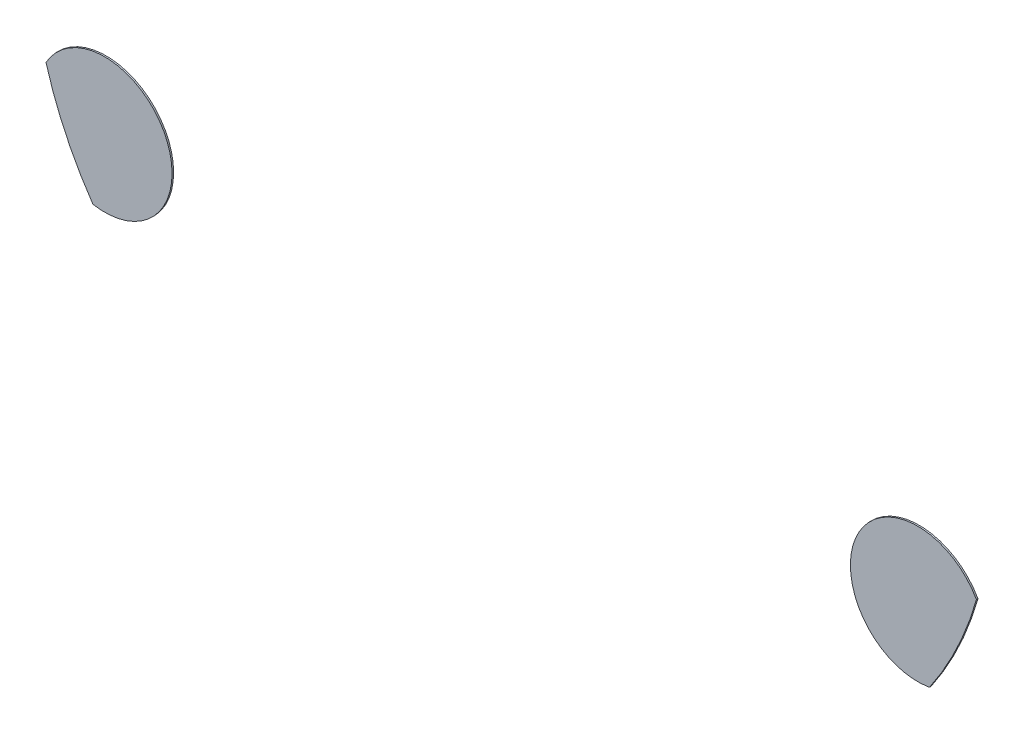
ISO-10303-21;
HEADER;
FILE_DESCRIPTION(('STEP AP214'),'2;1');
FILE_NAME('part.step','',(''),(''),'','','');
FILE_SCHEMA(('AUTOMOTIVE_DESIGN { 1 0 10303 214 1 1 1 1 }'));
ENDSEC;
DATA;
#1=APPLICATION_CONTEXT('core data for automotive mechanical design processes');
#2=APPLICATION_PROTOCOL_DEFINITION('international standard','automotive_design',2000,#1);
#3=PRODUCT_CONTEXT('',#1,'mechanical');
#4=PRODUCT('Part','Part','',(#3));
#5=PRODUCT_RELATED_PRODUCT_CATEGORY('part','',(#4));
#6=PRODUCT_DEFINITION_FORMATION('','',#4);
#7=PRODUCT_DEFINITION_CONTEXT('part definition',#1,'design');
#8=PRODUCT_DEFINITION('design','',#6,#7);
#9=PRODUCT_DEFINITION_SHAPE('','',#8);
#10=(LENGTH_UNIT() NAMED_UNIT(*) SI_UNIT(.MILLI.,.METRE.));
#11=(NAMED_UNIT(*) PLANE_ANGLE_UNIT() SI_UNIT($,.RADIAN.));
#12=(NAMED_UNIT(*) SI_UNIT($,.STERADIAN.) SOLID_ANGLE_UNIT());
#13=UNCERTAINTY_MEASURE_WITH_UNIT(LENGTH_MEASURE(1.E-05),#10,'distance_accuracy_value','');
#14=(GEOMETRIC_REPRESENTATION_CONTEXT(3) GLOBAL_UNCERTAINTY_ASSIGNED_CONTEXT((#13)) GLOBAL_UNIT_ASSIGNED_CONTEXT((#10,
#11,#12)) REPRESENTATION_CONTEXT('',''));
#15=CARTESIAN_POINT('',(0.,0.,0.));
#16=DIRECTION('',(0.,0.,1.));
#17=DIRECTION('',(1.,0.,0.));
#18=AXIS2_PLACEMENT_3D('',#15,#16,#17);
#19=CARTESIAN_POINT('',(60.1352829441877,31.3870417419867,0.1));
#20=DIRECTION('',(0.,0.,-1.));
#21=DIRECTION('',(-1.,0.,0.));
#22=AXIS2_PLACEMENT_3D('',#19,#20,#21);
#23=CYLINDRICAL_SURFACE('',#22,4.34647340931751);
#24=CARTESIAN_POINT('',(60.1352829441877,31.3870417419867,0.));
#25=DIRECTION('',(0.,0.,1.));
#26=DIRECTION('',(1.,0.,0.));
#27=AXIS2_PLACEMENT_3D('',#24,#25,#26);
#28=CIRCLE('',#27,4.34647340931751);
#29=CARTESIAN_POINT('',(63.9221170212046,33.5205174908639,0.));
#30=VERTEX_POINT('',#29);
#31=CARTESIAN_POINT('',(60.8938389119322,27.1072725961445,0.));
#32=VERTEX_POINT('',#31);
#33=EDGE_CURVE('E74',#30,#32,#28,.T.);
#34=ORIENTED_EDGE('',*,*,#33,.T.);
#35=DIRECTION('',(0.,0.,-1.));
#36=VECTOR('',#35,1.);
#37=CARTESIAN_POINT('',(60.8938389119322,27.1072725961445,0.1));
#38=LINE('',#37,#36);
#39=CARTESIAN_POINT('',(60.8938389119322,27.1072725961445,0.1));
#40=VERTEX_POINT('',#39);
#41=EDGE_CURVE('E12',#40,#32,#38,.T.);
#42=ORIENTED_EDGE('',*,*,#41,.F.);
#43=CARTESIAN_POINT('',(60.1352829441877,31.3870417419867,0.1));
#44=DIRECTION('',(0.,0.,1.));
#45=DIRECTION('',(1.,0.,0.));
#46=AXIS2_PLACEMENT_3D('',#43,#44,#45);
#47=CIRCLE('',#46,4.34647340931751);
#48=CARTESIAN_POINT('',(63.9221170212046,33.5205174908639,0.1));
#49=VERTEX_POINT('',#48);
#50=EDGE_CURVE('E73',#49,#40,#47,.T.);
#51=ORIENTED_EDGE('',*,*,#50,.F.);
#52=DIRECTION('',(0.,0.,-1.));
#53=VECTOR('',#52,1.);
#54=CARTESIAN_POINT('',(63.9221170212046,33.5205174908639,0.1));
#55=LINE('',#54,#53);
#56=EDGE_CURVE('E51',#49,#30,#55,.T.);
#57=ORIENTED_EDGE('',*,*,#56,.T.);
#58=EDGE_LOOP('',(#34,#42,#51,#57));
#59=FACE_BOUND('',#58,.T.);
#60=ADVANCED_FACE('F43',(#59),#23,.T.);
#61=CARTESIAN_POINT('',(42.7405750880003,39.6006705496834,0.1));
#62=DIRECTION('',(0.,0.,-1.));
#63=DIRECTION('',(-1.,0.,0.));
#64=AXIS2_PLACEMENT_3D('',#61,#62,#63);
#65=CYLINDRICAL_SURFACE('',#64,22.0369231038901);
#66=CARTESIAN_POINT('',(42.7405750880003,39.6006705496834,0.));
#67=DIRECTION('',(0.,0.,1.));
#68=DIRECTION('',(1.,0.,0.));
#69=AXIS2_PLACEMENT_3D('',#66,#67,#68);
#70=CIRCLE('',#69,22.0369231038901);
#71=EDGE_CURVE('E66',#32,#30,#70,.T.);
#72=ORIENTED_EDGE('',*,*,#71,.T.);
#73=ORIENTED_EDGE('',*,*,#56,.F.);
#74=CARTESIAN_POINT('',(42.7405750880003,39.6006705496834,0.1));
#75=DIRECTION('',(0.,0.,1.));
#76=DIRECTION('',(1.,0.,0.));
#77=AXIS2_PLACEMENT_3D('',#74,#75,#76);
#78=CIRCLE('',#77,22.0369231038901);
#79=EDGE_CURVE('E58',#40,#49,#78,.T.);
#80=ORIENTED_EDGE('',*,*,#79,.F.);
#81=ORIENTED_EDGE('',*,*,#41,.T.);
#82=EDGE_LOOP('',(#72,#73,#80,#81));
#83=FACE_BOUND('',#82,.T.);
#84=ADVANCED_FACE('F69',(#83),#65,.T.);
#85=CARTESIAN_POINT('',(51.437929016094,35.493856145835,0.1));
#86=DIRECTION('',(0.,0.,1.));
#87=DIRECTION('',(1.,0.,0.));
#88=AXIS2_PLACEMENT_3D('',#85,#86,#87);
#89=PLANE('',#88);
#90=ORIENTED_EDGE('',*,*,#50,.T.);
#91=ORIENTED_EDGE('',*,*,#79,.T.);
#92=EDGE_LOOP('',(#90,#91));
#93=FACE_BOUND('',#92,.T.);
#94=ADVANCED_FACE('F81',(#93),#89,.T.);
#95=CARTESIAN_POINT('',(51.437929016094,35.493856145835,0.));
#96=DIRECTION('',(0.,0.,1.));
#97=DIRECTION('',(1.,0.,0.));
#98=AXIS2_PLACEMENT_3D('',#95,#96,#97);
#99=PLANE('',#98);
#100=ORIENTED_EDGE('',*,*,#33,.F.);
#101=ORIENTED_EDGE('',*,*,#71,.F.);
#102=EDGE_LOOP('',(#100,#101));
#103=FACE_BOUND('',#102,.T.);
#104=ADVANCED_FACE('F77',(#103),#99,.F.);
#105=CLOSED_SHELL('',(#60,#84,#94,#104));
#106=MANIFOLD_SOLID_BREP('B2',#105);
#107=CARTESIAN_POINT('',(7.67700533041683,31.3870417419867,0.1));
#108=DIRECTION('',(0.,0.,-1.));
#109=DIRECTION('',(-1.,0.,0.));
#110=AXIS2_PLACEMENT_3D('',#107,#108,#109);
#111=CYLINDRICAL_SURFACE('',#110,4.3464734093175);
#112=CARTESIAN_POINT('',(7.67700533041683,31.3870417419867,0.));
#113=DIRECTION('',(0.,0.,1.));
#114=DIRECTION('',(1.,0.,0.));
#115=AXIS2_PLACEMENT_3D('',#112,#113,#114);
#116=CIRCLE('',#115,4.3464734093175);
#117=CARTESIAN_POINT('',(6.9184493626722,27.1072725961445,0.));
#118=VERTEX_POINT('',#117);
#119=CARTESIAN_POINT('',(3.89017125339985,33.5205174908639,0.));
#120=VERTEX_POINT('',#119);
#121=EDGE_CURVE('E146',#118,#120,#116,.T.);
#122=ORIENTED_EDGE('',*,*,#121,.T.);
#123=DIRECTION('',(0.,0.,-1.));
#124=VECTOR('',#123,1.);
#125=CARTESIAN_POINT('',(3.89017125339985,33.5205174908639,0.1));
#126=LINE('',#125,#124);
#127=CARTESIAN_POINT('',(3.89017125339985,33.5205174908639,0.1));
#128=VERTEX_POINT('',#127);
#129=EDGE_CURVE('E41',#128,#120,#126,.T.);
#130=ORIENTED_EDGE('',*,*,#129,.F.);
#131=CARTESIAN_POINT('',(7.67700533041683,31.3870417419867,0.1));
#132=DIRECTION('',(0.,0.,1.));
#133=DIRECTION('',(1.,0.,0.));
#134=AXIS2_PLACEMENT_3D('',#131,#132,#133);
#135=CIRCLE('',#134,4.3464734093175);
#136=CARTESIAN_POINT('',(6.9184493626722,27.1072725961445,0.1));
#137=VERTEX_POINT('',#136);
#138=EDGE_CURVE('E145',#137,#128,#135,.T.);
#139=ORIENTED_EDGE('',*,*,#138,.F.);
#140=DIRECTION('',(0.,0.,-1.));
#141=VECTOR('',#140,1.);
#142=CARTESIAN_POINT('',(6.9184493626722,27.1072725961445,0.1));
#143=LINE('',#142,#141);
#144=EDGE_CURVE('E123',#137,#118,#143,.T.);
#145=ORIENTED_EDGE('',*,*,#144,.T.);
#146=EDGE_LOOP('',(#122,#130,#139,#145));
#147=FACE_BOUND('',#146,.T.);
#148=ADVANCED_FACE('F115',(#147),#111,.T.);
#149=CARTESIAN_POINT('',(25.0717131866042,39.6006705496832,0.1));
#150=DIRECTION('',(0.,0.,-1.));
#151=DIRECTION('',(-1.,0.,0.));
#152=AXIS2_PLACEMENT_3D('',#149,#150,#151);
#153=CYLINDRICAL_SURFACE('',#152,22.0369231038901);
#154=CARTESIAN_POINT('',(25.0717131866042,39.6006705496832,0.));
#155=DIRECTION('',(0.,0.,1.));
#156=DIRECTION('',(1.,0.,0.));
#157=AXIS2_PLACEMENT_3D('',#154,#155,#156);
#158=CIRCLE('',#157,22.0369231038901);
#159=EDGE_CURVE('E138',#120,#118,#158,.T.);
#160=ORIENTED_EDGE('',*,*,#159,.T.);
#161=ORIENTED_EDGE('',*,*,#144,.F.);
#162=CARTESIAN_POINT('',(25.0717131866042,39.6006705496832,0.1));
#163=DIRECTION('',(0.,0.,1.));
#164=DIRECTION('',(1.,0.,0.));
#165=AXIS2_PLACEMENT_3D('',#162,#163,#164);
#166=CIRCLE('',#165,22.0369231038901);
#167=EDGE_CURVE('E130',#128,#137,#166,.T.);
#168=ORIENTED_EDGE('',*,*,#167,.F.);
#169=ORIENTED_EDGE('',*,*,#129,.T.);
#170=EDGE_LOOP('',(#160,#161,#168,#169));
#171=FACE_BOUND('',#170,.T.);
#172=ADVANCED_FACE('F141',(#171),#153,.T.);
#173=CARTESIAN_POINT('',(16.3743592585105,35.493856145835,0.1));
#174=DIRECTION('',(0.,0.,1.));
#175=DIRECTION('',(1.,0.,0.));
#176=AXIS2_PLACEMENT_3D('',#173,#174,#175);
#177=PLANE('',#176);
#178=ORIENTED_EDGE('',*,*,#138,.T.);
#179=ORIENTED_EDGE('',*,*,#167,.T.);
#180=EDGE_LOOP('',(#178,#179));
#181=FACE_BOUND('',#180,.T.);
#182=ADVANCED_FACE('F153',(#181),#177,.T.);
#183=CARTESIAN_POINT('',(16.3743592585105,35.493856145835,0.));
#184=DIRECTION('',(0.,0.,1.));
#185=DIRECTION('',(1.,0.,0.));
#186=AXIS2_PLACEMENT_3D('',#183,#184,#185);
#187=PLANE('',#186);
#188=ORIENTED_EDGE('',*,*,#121,.F.);
#189=ORIENTED_EDGE('',*,*,#159,.F.);
#190=EDGE_LOOP('',(#188,#189));
#191=FACE_BOUND('',#190,.T.);
#192=ADVANCED_FACE('F149',(#191),#187,.F.);
#193=CLOSED_SHELL('',(#148,#172,#182,#192));
#194=MANIFOLD_SOLID_BREP('B6',#193);
#195=ADVANCED_BREP_SHAPE_REPRESENTATION('',(#18,#106,#194),#14);
#196=SHAPE_DEFINITION_REPRESENTATION(#9,#195);
ENDSEC;
END-ISO-10303-21;
